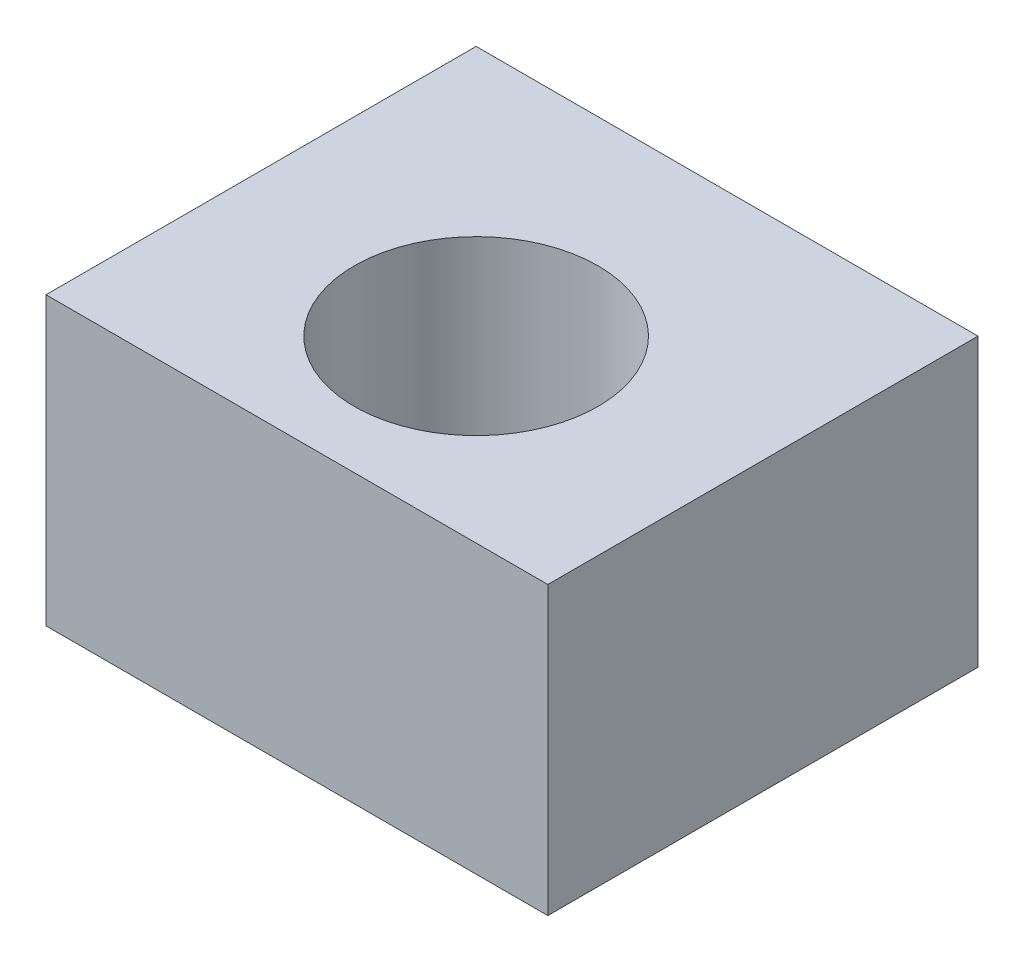
ISO-10303-21;
HEADER;
FILE_DESCRIPTION(('STEP AP214'),'2;1');
FILE_NAME('part.step','',(''),(''),'','','');
FILE_SCHEMA(('AUTOMOTIVE_DESIGN { 1 0 10303 214 1 1 1 1 }'));
ENDSEC;
DATA;
#1=APPLICATION_CONTEXT('core data for automotive mechanical design processes');
#2=APPLICATION_PROTOCOL_DEFINITION('international standard','automotive_design',2000,#1);
#3=PRODUCT_CONTEXT('',#1,'mechanical');
#4=PRODUCT('Part','Part','',(#3));
#5=PRODUCT_RELATED_PRODUCT_CATEGORY('part','',(#4));
#6=PRODUCT_DEFINITION_FORMATION('','',#4);
#7=PRODUCT_DEFINITION_CONTEXT('part definition',#1,'design');
#8=PRODUCT_DEFINITION('design','',#6,#7);
#9=PRODUCT_DEFINITION_SHAPE('','',#8);
#10=(LENGTH_UNIT() NAMED_UNIT(*) SI_UNIT(.MILLI.,.METRE.));
#11=(NAMED_UNIT(*) PLANE_ANGLE_UNIT() SI_UNIT($,.RADIAN.));
#12=(NAMED_UNIT(*) SI_UNIT($,.STERADIAN.) SOLID_ANGLE_UNIT());
#13=UNCERTAINTY_MEASURE_WITH_UNIT(LENGTH_MEASURE(1.E-05),#10,'distance_accuracy_value','');
#14=(GEOMETRIC_REPRESENTATION_CONTEXT(3) GLOBAL_UNCERTAINTY_ASSIGNED_CONTEXT((#13)) GLOBAL_UNIT_ASSIGNED_CONTEXT((#10,
#11,#12)) REPRESENTATION_CONTEXT('',''));
#15=CARTESIAN_POINT('',(0.,0.,0.));
#16=DIRECTION('',(0.,0.,1.));
#17=DIRECTION('',(1.,0.,0.));
#18=AXIS2_PLACEMENT_3D('',#15,#16,#17);
#19=CARTESIAN_POINT('',(0.,20.,0.));
#20=DIRECTION('',(0.,-1.,0.));
#21=DIRECTION('',(0.,0.,-1.));
#22=AXIS2_PLACEMENT_3D('',#19,#20,#21);
#23=PLANE('',#22);
#24=CARTESIAN_POINT('',(0.,20.,0.));
#25=DIRECTION('',(0.,-1.,0.));
#26=DIRECTION('',(0.,0.,-1.));
#27=AXIS2_PLACEMENT_3D('',#24,#25,#26);
#28=CIRCLE('',#27,8.5);
#29=CARTESIAN_POINT('',(0.,20.,-8.5));
#30=VERTEX_POINT('',#29);
#31=EDGE_CURVE('E133',#30,#30,#28,.T.);
#32=ORIENTED_EDGE('',*,*,#31,.T.);
#33=EDGE_LOOP('',(#32));
#34=FACE_BOUND('',#33,.T.);
#35=DIRECTION('',(0.,0.,1.));
#36=VECTOR('',#35,1.);
#37=CARTESIAN_POINT('',(-17.5,20.,17.5));
#38=LINE('',#37,#36);
#39=CARTESIAN_POINT('',(-17.5,20.,-17.5));
#40=VERTEX_POINT('',#39);
#41=CARTESIAN_POINT('',(-17.5,20.,12.5));
#42=VERTEX_POINT('',#41);
#43=EDGE_CURVE('E141',#40,#42,#38,.T.);
#44=ORIENTED_EDGE('',*,*,#43,.T.);
#45=DIRECTION('',(-1.,0.,0.));
#46=VECTOR('',#45,1.);
#47=CARTESIAN_POINT('',(-17.5,20.,12.5));
#48=LINE('',#47,#46);
#49=CARTESIAN_POINT('',(17.5,20.,12.5));
#50=VERTEX_POINT('',#49);
#51=EDGE_CURVE('E127',#50,#42,#48,.T.);
#52=ORIENTED_EDGE('',*,*,#51,.F.);
#53=DIRECTION('',(0.,0.,-1.));
#54=VECTOR('',#53,1.);
#55=CARTESIAN_POINT('',(17.5,20.,17.5));
#56=LINE('',#55,#54);
#57=CARTESIAN_POINT('',(17.5,20.,-17.5));
#58=VERTEX_POINT('',#57);
#59=EDGE_CURVE('E139',#50,#58,#56,.T.);
#60=ORIENTED_EDGE('',*,*,#59,.T.);
#61=DIRECTION('',(-1.,0.,0.));
#62=VECTOR('',#61,1.);
#63=CARTESIAN_POINT('',(22.5,20.,-17.5));
#64=LINE('',#63,#62);
#65=EDGE_CURVE('E122',#58,#40,#64,.T.);
#66=ORIENTED_EDGE('',*,*,#65,.T.);
#67=EDGE_LOOP('',(#44,#52,#60,#66));
#68=FACE_BOUND('',#67,.T.);
#69=ADVANCED_FACE('F39',(#34,#68),#23,.F.);
#70=CARTESIAN_POINT('',(17.5,20.,17.5));
#71=DIRECTION('',(-1.,0.,0.));
#72=DIRECTION('',(0.,0.,1.));
#73=AXIS2_PLACEMENT_3D('',#70,#71,#72);
#74=PLANE('',#73);
#75=DIRECTION('',(0.,-1.,0.));
#76=VECTOR('',#75,1.);
#77=CARTESIAN_POINT('',(17.5,20.,-17.5));
#78=LINE('',#77,#76);
#79=CARTESIAN_POINT('',(17.5,0.,-17.5));
#80=VERTEX_POINT('',#79);
#81=EDGE_CURVE('E11',#58,#80,#78,.T.);
#82=ORIENTED_EDGE('',*,*,#81,.F.);
#83=ORIENTED_EDGE('',*,*,#59,.F.);
#84=DIRECTION('',(0.,1.,0.));
#85=VECTOR('',#84,1.);
#86=CARTESIAN_POINT('',(17.5,-0.001000000000001,12.5));
#87=LINE('',#86,#85);
#88=CARTESIAN_POINT('',(17.5,0.,12.5));
#89=VERTEX_POINT('',#88);
#90=EDGE_CURVE('E129',#89,#50,#87,.T.);
#91=ORIENTED_EDGE('',*,*,#90,.F.);
#92=DIRECTION('',(0.,0.,-1.));
#93=VECTOR('',#92,1.);
#94=CARTESIAN_POINT('',(17.5,0.,17.5));
#95=LINE('',#94,#93);
#96=EDGE_CURVE('E136',#89,#80,#95,.T.);
#97=ORIENTED_EDGE('',*,*,#96,.T.);
#98=EDGE_LOOP('',(#82,#83,#91,#97));
#99=FACE_BOUND('',#98,.T.);
#100=ADVANCED_FACE('F41',(#99),#74,.F.);
#101=CARTESIAN_POINT('',(-17.5,20.,-17.5));
#102=DIRECTION('',(0.,0.,1.));
#103=DIRECTION('',(1.,0.,0.));
#104=AXIS2_PLACEMENT_3D('',#101,#102,#103);
#105=PLANE('',#104);
#106=DIRECTION('',(0.,-1.,0.));
#107=VECTOR('',#106,1.);
#108=CARTESIAN_POINT('',(-17.5,20.,-17.5));
#109=LINE('',#108,#107);
#110=CARTESIAN_POINT('',(-17.5,0.,-17.5));
#111=VERTEX_POINT('',#110);
#112=EDGE_CURVE('E47',#40,#111,#109,.T.);
#113=ORIENTED_EDGE('',*,*,#112,.F.);
#114=ORIENTED_EDGE('',*,*,#65,.F.);
#115=ORIENTED_EDGE('',*,*,#81,.T.);
#116=DIRECTION('',(-1.,0.,0.));
#117=VECTOR('',#116,1.);
#118=CARTESIAN_POINT('',(-17.5,0.,-17.5));
#119=LINE('',#118,#117);
#120=EDGE_CURVE('E147',#80,#111,#119,.T.);
#121=ORIENTED_EDGE('',*,*,#120,.T.);
#122=EDGE_LOOP('',(#113,#114,#115,#121));
#123=FACE_BOUND('',#122,.T.);
#124=ADVANCED_FACE('F165',(#123),#105,.F.);
#125=CARTESIAN_POINT('',(-17.5,20.,17.5));
#126=DIRECTION('',(1.,0.,0.));
#127=DIRECTION('',(0.,0.,-1.));
#128=AXIS2_PLACEMENT_3D('',#125,#126,#127);
#129=PLANE('',#128);
#130=ORIENTED_EDGE('',*,*,#43,.F.);
#131=ORIENTED_EDGE('',*,*,#112,.T.);
#132=DIRECTION('',(0.,0.,1.));
#133=VECTOR('',#132,1.);
#134=CARTESIAN_POINT('',(-17.5,0.,17.5));
#135=LINE('',#134,#133);
#136=CARTESIAN_POINT('',(-17.5,0.,12.5));
#137=VERTEX_POINT('',#136);
#138=EDGE_CURVE('E142',#111,#137,#135,.T.);
#139=ORIENTED_EDGE('',*,*,#138,.T.);
#140=DIRECTION('',(0.,1.,0.));
#141=VECTOR('',#140,1.);
#142=CARTESIAN_POINT('',(-17.5,-0.001000000000001,12.5));
#143=LINE('',#142,#141);
#144=EDGE_CURVE('E54',#137,#42,#143,.T.);
#145=ORIENTED_EDGE('',*,*,#144,.T.);
#146=EDGE_LOOP('',(#130,#131,#139,#145));
#147=FACE_BOUND('',#146,.T.);
#148=ADVANCED_FACE('F150',(#147),#129,.F.);
#149=CARTESIAN_POINT('',(0.,0.,0.));
#150=DIRECTION('',(0.,-1.,0.));
#151=DIRECTION('',(0.,0.,-1.));
#152=AXIS2_PLACEMENT_3D('',#149,#150,#151);
#153=PLANE('',#152);
#154=CARTESIAN_POINT('',(-12.5,0.,-5.5));
#155=DIRECTION('',(0.,-1.,0.));
#156=DIRECTION('',(0.,0.,-1.));
#157=AXIS2_PLACEMENT_3D('',#154,#155,#156);
#158=CIRCLE('',#157,1.24999999999999);
#159=CARTESIAN_POINT('',(-12.5,0.,-6.74999999999999));
#160=VERTEX_POINT('',#159);
#161=EDGE_CURVE('E100',#160,#160,#158,.T.);
#162=ORIENTED_EDGE('',*,*,#161,.F.);
#163=EDGE_LOOP('',(#162));
#164=FACE_BOUND('',#163,.T.);
#165=CARTESIAN_POINT('',(12.5,0.,-5.5));
#166=DIRECTION('',(0.,-1.,0.));
#167=DIRECTION('',(0.,0.,-1.));
#168=AXIS2_PLACEMENT_3D('',#165,#166,#167);
#169=CIRCLE('',#168,1.24999999999999);
#170=CARTESIAN_POINT('',(12.5,0.,-6.74999999999999));
#171=VERTEX_POINT('',#170);
#172=EDGE_CURVE('E99',#171,#171,#169,.T.);
#173=ORIENTED_EDGE('',*,*,#172,.F.);
#174=EDGE_LOOP('',(#173));
#175=FACE_BOUND('',#174,.T.);
#176=CARTESIAN_POINT('',(12.5,0.,9.5));
#177=DIRECTION('',(0.,-1.,0.));
#178=DIRECTION('',(0.,0.,-1.));
#179=AXIS2_PLACEMENT_3D('',#176,#177,#178);
#180=CIRCLE('',#179,1.24999999999999);
#181=CARTESIAN_POINT('',(12.5,0.,8.25000000000001));
#182=VERTEX_POINT('',#181);
#183=EDGE_CURVE('E110',#182,#182,#180,.T.);
#184=ORIENTED_EDGE('',*,*,#183,.F.);
#185=EDGE_LOOP('',(#184));
#186=FACE_BOUND('',#185,.T.);
#187=CARTESIAN_POINT('',(-12.5,0.,9.5));
#188=DIRECTION('',(0.,-1.,0.));
#189=DIRECTION('',(0.,0.,-1.));
#190=AXIS2_PLACEMENT_3D('',#187,#188,#189);
#191=CIRCLE('',#190,1.24999999999999);
#192=CARTESIAN_POINT('',(-12.5,0.,8.25000000000001));
#193=VERTEX_POINT('',#192);
#194=EDGE_CURVE('E116',#193,#193,#191,.T.);
#195=ORIENTED_EDGE('',*,*,#194,.F.);
#196=EDGE_LOOP('',(#195));
#197=FACE_BOUND('',#196,.T.);
#198=DIRECTION('',(-1.,0.,0.));
#199=VECTOR('',#198,1.);
#200=CARTESIAN_POINT('',(-17.5,0.,12.5));
#201=LINE('',#200,#199);
#202=EDGE_CURVE('E125',#89,#137,#201,.T.);
#203=ORIENTED_EDGE('',*,*,#202,.T.);
#204=ORIENTED_EDGE('',*,*,#138,.F.);
#205=ORIENTED_EDGE('',*,*,#120,.F.);
#206=ORIENTED_EDGE('',*,*,#96,.F.);
#207=EDGE_LOOP('',(#203,#204,#205,#206));
#208=FACE_BOUND('',#207,.T.);
#209=CARTESIAN_POINT('',(0.,0.,0.));
#210=DIRECTION('',(0.,-1.,0.));
#211=DIRECTION('',(0.,0.,-1.));
#212=AXIS2_PLACEMENT_3D('',#209,#210,#211);
#213=CIRCLE('',#212,8.5);
#214=CARTESIAN_POINT('',(0.,0.,-8.5));
#215=VERTEX_POINT('',#214);
#216=EDGE_CURVE('E131',#215,#215,#213,.T.);
#217=ORIENTED_EDGE('',*,*,#216,.F.);
#218=EDGE_LOOP('',(#217));
#219=FACE_BOUND('',#218,.T.);
#220=ADVANCED_FACE('F153',(#164,#175,#186,#197,#208,#219),#153,.T.);
#221=CARTESIAN_POINT('',(0.,20.,0.));
#222=DIRECTION('',(0.,-1.,0.));
#223=DIRECTION('',(0.,0.,-1.));
#224=AXIS2_PLACEMENT_3D('',#221,#222,#223);
#225=CYLINDRICAL_SURFACE('',#224,8.5);
#226=ORIENTED_EDGE('',*,*,#31,.F.);
#227=EDGE_LOOP('',(#226));
#228=FACE_BOUND('',#227,.T.);
#229=ORIENTED_EDGE('',*,*,#216,.T.);
#230=EDGE_LOOP('',(#229));
#231=FACE_BOUND('',#230,.T.);
#232=ADVANCED_FACE('F179',(#228,#231),#225,.F.);
#233=CARTESIAN_POINT('',(-17.5,-0.001000000000001,12.5));
#234=DIRECTION('',(0.,0.,-1.));
#235=DIRECTION('',(-1.,0.,0.));
#236=AXIS2_PLACEMENT_3D('',#233,#234,#235);
#237=PLANE('',#236);
#238=ORIENTED_EDGE('',*,*,#90,.T.);
#239=ORIENTED_EDGE('',*,*,#51,.T.);
#240=ORIENTED_EDGE('',*,*,#144,.F.);
#241=ORIENTED_EDGE('',*,*,#202,.F.);
#242=EDGE_LOOP('',(#238,#239,#240,#241));
#243=FACE_BOUND('',#242,.T.);
#244=ADVANCED_FACE('F157',(#243),#237,.F.);
#245=CARTESIAN_POINT('',(-12.5,7.49999999999999,9.5));
#246=DIRECTION('',(0.,-1.,0.));
#247=DIRECTION('',(0.,0.,-1.));
#248=AXIS2_PLACEMENT_3D('',#245,#246,#247);
#249=CONICAL_SURFACE('',#248,1.24999999999999,1.02974425867664);
#250=CARTESIAN_POINT('',(-12.5,8.25107577378445,9.5));
#251=VERTEX_POINT('',#250);
#252=VERTEX_LOOP('',#251);
#253=FACE_BOUND('',#252,.T.);
#254=CARTESIAN_POINT('',(-12.5,7.49999999999999,9.5));
#255=DIRECTION('',(0.,-1.,0.));
#256=DIRECTION('',(0.,0.,-1.));
#257=AXIS2_PLACEMENT_3D('',#254,#255,#256);
#258=CIRCLE('',#257,1.24999999999999);
#259=CARTESIAN_POINT('',(-12.5,7.49999999999999,8.25000000000001));
#260=VERTEX_POINT('',#259);
#261=EDGE_CURVE('E119',#260,#260,#258,.T.);
#262=ORIENTED_EDGE('',*,*,#261,.T.);
#263=EDGE_LOOP('',(#262));
#264=FACE_BOUND('',#263,.T.);
#265=ADVANCED_FACE('F198',(#253,#264),#249,.F.);
#266=CARTESIAN_POINT('',(-12.5,0.,9.5));
#267=DIRECTION('',(0.,-1.,0.));
#268=DIRECTION('',(0.,0.,-1.));
#269=AXIS2_PLACEMENT_3D('',#266,#267,#268);
#270=CYLINDRICAL_SURFACE('',#269,1.24999999999999);
#271=ORIENTED_EDGE('',*,*,#261,.F.);
#272=EDGE_LOOP('',(#271));
#273=FACE_BOUND('',#272,.T.);
#274=ORIENTED_EDGE('',*,*,#194,.T.);
#275=EDGE_LOOP('',(#274));
#276=FACE_BOUND('',#275,.T.);
#277=ADVANCED_FACE('F195',(#273,#276),#270,.F.);
#278=CARTESIAN_POINT('',(12.5,7.49999999999999,9.5));
#279=DIRECTION('',(0.,-1.,0.));
#280=DIRECTION('',(0.,0.,-1.));
#281=AXIS2_PLACEMENT_3D('',#278,#279,#280);
#282=CONICAL_SURFACE('',#281,1.24999999999999,1.02974425867664);
#283=CARTESIAN_POINT('',(12.5,8.25107577378445,9.5));
#284=VERTEX_POINT('',#283);
#285=VERTEX_LOOP('',#284);
#286=FACE_BOUND('',#285,.T.);
#287=CARTESIAN_POINT('',(12.5,7.49999999999999,9.5));
#288=DIRECTION('',(0.,-1.,0.));
#289=DIRECTION('',(0.,0.,-1.));
#290=AXIS2_PLACEMENT_3D('',#287,#288,#289);
#291=CIRCLE('',#290,1.24999999999999);
#292=CARTESIAN_POINT('',(12.5,7.49999999999999,8.25000000000001));
#293=VERTEX_POINT('',#292);
#294=EDGE_CURVE('E113',#293,#293,#291,.T.);
#295=ORIENTED_EDGE('',*,*,#294,.T.);
#296=EDGE_LOOP('',(#295));
#297=FACE_BOUND('',#296,.T.);
#298=ADVANCED_FACE('F197',(#286,#297),#282,.F.);
#299=CARTESIAN_POINT('',(12.5,0.,9.5));
#300=DIRECTION('',(0.,-1.,0.));
#301=DIRECTION('',(0.,0.,-1.));
#302=AXIS2_PLACEMENT_3D('',#299,#300,#301);
#303=CYLINDRICAL_SURFACE('',#302,1.24999999999999);
#304=ORIENTED_EDGE('',*,*,#294,.F.);
#305=EDGE_LOOP('',(#304));
#306=FACE_BOUND('',#305,.T.);
#307=ORIENTED_EDGE('',*,*,#183,.T.);
#308=EDGE_LOOP('',(#307));
#309=FACE_BOUND('',#308,.T.);
#310=ADVANCED_FACE('F205',(#306,#309),#303,.F.);
#311=CARTESIAN_POINT('',(12.5,7.49999999999999,-5.5));
#312=DIRECTION('',(0.,-1.,0.));
#313=DIRECTION('',(0.,0.,-1.));
#314=AXIS2_PLACEMENT_3D('',#311,#312,#313);
#315=CONICAL_SURFACE('',#314,1.24999999999999,1.02974425867664);
#316=CARTESIAN_POINT('',(12.5,8.25107577378445,-5.5));
#317=VERTEX_POINT('',#316);
#318=VERTEX_LOOP('',#317);
#319=FACE_BOUND('',#318,.T.);
#320=CARTESIAN_POINT('',(12.5,7.49999999999999,-5.5));
#321=DIRECTION('',(0.,-1.,0.));
#322=DIRECTION('',(0.,0.,-1.));
#323=AXIS2_PLACEMENT_3D('',#320,#321,#322);
#324=CIRCLE('',#323,1.24999999999999);
#325=CARTESIAN_POINT('',(12.5,7.49999999999999,-6.74999999999998));
#326=VERTEX_POINT('',#325);
#327=EDGE_CURVE('E103',#326,#326,#324,.T.);
#328=ORIENTED_EDGE('',*,*,#327,.T.);
#329=EDGE_LOOP('',(#328));
#330=FACE_BOUND('',#329,.T.);
#331=ADVANCED_FACE('F248',(#319,#330),#315,.F.);
#332=CARTESIAN_POINT('',(12.5,0.,-5.5));
#333=DIRECTION('',(0.,-1.,0.));
#334=DIRECTION('',(0.,0.,-1.));
#335=AXIS2_PLACEMENT_3D('',#332,#333,#334);
#336=CYLINDRICAL_SURFACE('',#335,1.24999999999999);
#337=ORIENTED_EDGE('',*,*,#327,.F.);
#338=EDGE_LOOP('',(#337));
#339=FACE_BOUND('',#338,.T.);
#340=ORIENTED_EDGE('',*,*,#172,.T.);
#341=EDGE_LOOP('',(#340));
#342=FACE_BOUND('',#341,.T.);
#343=ADVANCED_FACE('F93',(#339,#342),#336,.F.);
#344=CARTESIAN_POINT('',(-12.5,7.49999999999999,-5.5));
#345=DIRECTION('',(0.,-1.,0.));
#346=DIRECTION('',(0.,0.,-1.));
#347=AXIS2_PLACEMENT_3D('',#344,#345,#346);
#348=CONICAL_SURFACE('',#347,1.24999999999999,1.02974425867664);
#349=CARTESIAN_POINT('',(-12.5,8.25107577378445,-5.5));
#350=VERTEX_POINT('',#349);
#351=VERTEX_LOOP('',#350);
#352=FACE_BOUND('',#351,.T.);
#353=CARTESIAN_POINT('',(-12.5,7.49999999999999,-5.5));
#354=DIRECTION('',(0.,-1.,0.));
#355=DIRECTION('',(0.,0.,-1.));
#356=AXIS2_PLACEMENT_3D('',#353,#354,#355);
#357=CIRCLE('',#356,1.24999999999999);
#358=CARTESIAN_POINT('',(-12.5,7.49999999999999,-6.74999999999998));
#359=VERTEX_POINT('',#358);
#360=EDGE_CURVE('E97',#359,#359,#357,.T.);
#361=ORIENTED_EDGE('',*,*,#360,.T.);
#362=EDGE_LOOP('',(#361));
#363=FACE_BOUND('',#362,.T.);
#364=ADVANCED_FACE('F89',(#352,#363),#348,.F.);
#365=CARTESIAN_POINT('',(-12.5,0.,-5.5));
#366=DIRECTION('',(0.,-1.,0.));
#367=DIRECTION('',(0.,0.,-1.));
#368=AXIS2_PLACEMENT_3D('',#365,#366,#367);
#369=CYLINDRICAL_SURFACE('',#368,1.24999999999999);
#370=ORIENTED_EDGE('',*,*,#360,.F.);
#371=EDGE_LOOP('',(#370));
#372=FACE_BOUND('',#371,.T.);
#373=ORIENTED_EDGE('',*,*,#161,.T.);
#374=EDGE_LOOP('',(#373));
#375=FACE_BOUND('',#374,.T.);
#376=ADVANCED_FACE('F92',(#372,#375),#369,.F.);
#377=CLOSED_SHELL('',(#69,#100,#124,#148,#220,#232,#244,#265,#277,#298,#310,#331,#343,#364,#376));
#378=MANIFOLD_SOLID_BREP('B2',#377);
#379=ADVANCED_BREP_SHAPE_REPRESENTATION('',(#18,#378),#14);
#380=SHAPE_DEFINITION_REPRESENTATION(#9,#379);
ENDSEC;
END-ISO-10303-21;
